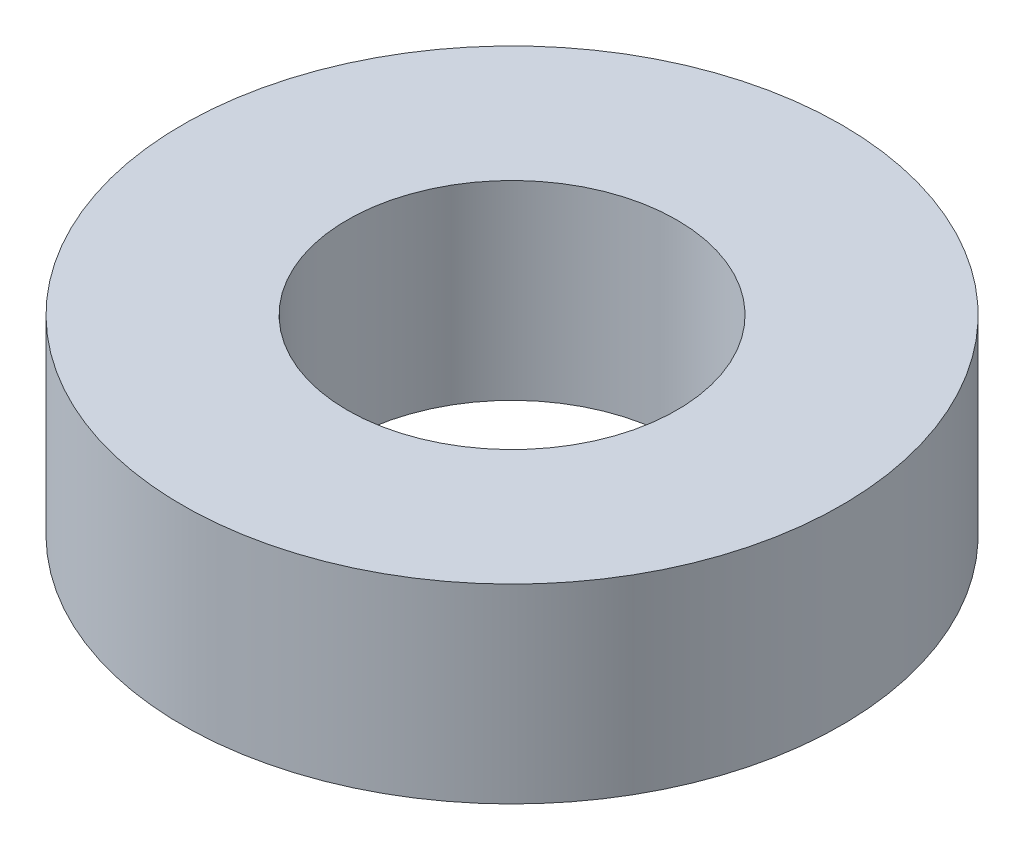
ISO-10303-21;
HEADER;
FILE_DESCRIPTION(('STEP AP214'),'2;1');
FILE_NAME('part.step','',(''),(''),'','','');
FILE_SCHEMA(('AUTOMOTIVE_DESIGN { 1 0 10303 214 1 1 1 1 }'));
ENDSEC;
DATA;
#1=APPLICATION_CONTEXT('core data for automotive mechanical design processes');
#2=APPLICATION_PROTOCOL_DEFINITION('international standard','automotive_design',2000,#1);
#3=PRODUCT_CONTEXT('',#1,'mechanical');
#4=PRODUCT('Part','Part','',(#3));
#5=PRODUCT_RELATED_PRODUCT_CATEGORY('part','',(#4));
#6=PRODUCT_DEFINITION_FORMATION('','',#4);
#7=PRODUCT_DEFINITION_CONTEXT('part definition',#1,'design');
#8=PRODUCT_DEFINITION('design','',#6,#7);
#9=PRODUCT_DEFINITION_SHAPE('','',#8);
#10=(LENGTH_UNIT() NAMED_UNIT(*) SI_UNIT(.MILLI.,.METRE.));
#11=(NAMED_UNIT(*) PLANE_ANGLE_UNIT() SI_UNIT($,.RADIAN.));
#12=(NAMED_UNIT(*) SI_UNIT($,.STERADIAN.) SOLID_ANGLE_UNIT());
#13=UNCERTAINTY_MEASURE_WITH_UNIT(LENGTH_MEASURE(1.E-05),#10,'distance_accuracy_value','');
#14=(GEOMETRIC_REPRESENTATION_CONTEXT(3) GLOBAL_UNCERTAINTY_ASSIGNED_CONTEXT((#13)) GLOBAL_UNIT_ASSIGNED_CONTEXT((#10,
#11,#12)) REPRESENTATION_CONTEXT('',''));
#15=CARTESIAN_POINT('',(0.,0.,0.));
#16=DIRECTION('',(0.,0.,1.));
#17=DIRECTION('',(1.,0.,0.));
#18=AXIS2_PLACEMENT_3D('',#15,#16,#17);
#19=CARTESIAN_POINT('',(0.,26.,0.));
#20=DIRECTION('',(0.,-1.,0.));
#21=DIRECTION('',(0.,0.,-1.));
#22=AXIS2_PLACEMENT_3D('',#19,#20,#21);
#23=CYLINDRICAL_SURFACE('',#22,45.);
#24=CARTESIAN_POINT('',(0.,26.,0.));
#25=DIRECTION('',(0.,1.,0.));
#26=DIRECTION('',(0.,0.,1.));
#27=AXIS2_PLACEMENT_3D('',#24,#25,#26);
#28=CIRCLE('',#27,45.);
#29=CARTESIAN_POINT('',(0.,26.,-45.));
#30=VERTEX_POINT('',#29);
#31=EDGE_CURVE('E10',#30,#30,#28,.T.);
#32=CARTESIAN_POINT('',(0.,0.,0.));
#33=DIRECTION('',(0.,1.,0.));
#34=DIRECTION('',(0.,0.,1.));
#35=AXIS2_PLACEMENT_3D('',#32,#33,#34);
#36=CIRCLE('',#35,45.);
#37=CARTESIAN_POINT('',(0.,0.,-45.));
#38=VERTEX_POINT('',#37);
#39=EDGE_CURVE('E37',#38,#38,#36,.T.);
#40=CARTESIAN_POINT('',(0.,26.,-45.));
#41=CARTESIAN_POINT('',(0.,25.7291666666667,-45.));
#42=CARTESIAN_POINT('',(0.,25.4583333333333,-45.));
#43=CARTESIAN_POINT('',(0.,24.9166666666667,-45.));
#44=CARTESIAN_POINT('',(0.,24.6458333333333,-45.));
#45=CARTESIAN_POINT('',(0.,24.1041666666667,-45.));
#46=CARTESIAN_POINT('',(0.,23.8333333333333,-45.));
#47=CARTESIAN_POINT('',(0.,23.2916666666667,-45.));
#48=CARTESIAN_POINT('',(0.,23.0208333333333,-45.));
#49=CARTESIAN_POINT('',(0.,22.4791666666667,-45.));
#50=CARTESIAN_POINT('',(0.,22.2083333333333,-45.));
#51=CARTESIAN_POINT('',(0.,21.6666666666667,-45.));
#52=CARTESIAN_POINT('',(0.,21.3958333333333,-45.));
#53=CARTESIAN_POINT('',(0.,20.8541666666667,-45.));
#54=CARTESIAN_POINT('',(0.,20.5833333333333,-45.));
#55=CARTESIAN_POINT('',(0.,20.0416666666667,-45.));
#56=CARTESIAN_POINT('',(0.,19.7708333333333,-45.));
#57=CARTESIAN_POINT('',(0.,19.2291666666667,-45.));
#58=CARTESIAN_POINT('',(0.,18.9583333333333,-45.));
#59=CARTESIAN_POINT('',(0.,18.4166666666667,-45.));
#60=CARTESIAN_POINT('',(0.,18.1458333333333,-45.));
#61=CARTESIAN_POINT('',(0.,17.6041666666667,-45.));
#62=CARTESIAN_POINT('',(0.,17.3333333333333,-45.));
#63=CARTESIAN_POINT('',(0.,16.7916666666667,-45.));
#64=CARTESIAN_POINT('',(0.,16.5208333333333,-45.));
#65=CARTESIAN_POINT('',(0.,15.9791666666667,-45.));
#66=CARTESIAN_POINT('',(0.,15.7083333333333,-45.));
#67=CARTESIAN_POINT('',(0.,15.1666666666667,-45.));
#68=CARTESIAN_POINT('',(0.,14.8958333333333,-45.));
#69=CARTESIAN_POINT('',(0.,14.3541666666667,-45.));
#70=CARTESIAN_POINT('',(0.,14.0833333333333,-45.));
#71=CARTESIAN_POINT('',(0.,13.5416666666667,-45.));
#72=CARTESIAN_POINT('',(0.,13.2708333333333,-45.));
#73=CARTESIAN_POINT('',(0.,12.7291666666667,-45.));
#74=CARTESIAN_POINT('',(0.,12.4583333333333,-45.));
#75=CARTESIAN_POINT('',(0.,11.9166666666667,-45.));
#76=CARTESIAN_POINT('',(0.,11.6458333333333,-45.));
#77=CARTESIAN_POINT('',(0.,11.1041666666667,-45.));
#78=CARTESIAN_POINT('',(0.,10.8333333333333,-45.));
#79=CARTESIAN_POINT('',(0.,10.2916666666667,-45.));
#80=CARTESIAN_POINT('',(0.,10.0208333333333,-45.));
#81=CARTESIAN_POINT('',(0.,9.47916666666667,-45.));
#82=CARTESIAN_POINT('',(0.,9.20833333333333,-45.));
#83=CARTESIAN_POINT('',(0.,8.66666666666667,-45.));
#84=CARTESIAN_POINT('',(0.,8.39583333333333,-45.));
#85=CARTESIAN_POINT('',(0.,7.85416666666667,-45.));
#86=CARTESIAN_POINT('',(0.,7.58333333333333,-45.));
#87=CARTESIAN_POINT('',(0.,7.04166666666667,-45.));
#88=CARTESIAN_POINT('',(0.,6.77083333333333,-45.));
#89=CARTESIAN_POINT('',(0.,6.22916666666667,-45.));
#90=CARTESIAN_POINT('',(0.,5.95833333333333,-45.));
#91=CARTESIAN_POINT('',(0.,5.41666666666667,-45.));
#92=CARTESIAN_POINT('',(0.,5.14583333333333,-45.));
#93=CARTESIAN_POINT('',(0.,4.60416666666667,-45.));
#94=CARTESIAN_POINT('',(0.,4.33333333333333,-45.));
#95=CARTESIAN_POINT('',(0.,3.79166666666667,-45.));
#96=CARTESIAN_POINT('',(0.,3.52083333333333,-45.));
#97=CARTESIAN_POINT('',(0.,2.97916666666667,-45.));
#98=CARTESIAN_POINT('',(0.,2.70833333333333,-45.));
#99=CARTESIAN_POINT('',(0.,2.16666666666667,-45.));
#100=CARTESIAN_POINT('',(0.,1.89583333333333,-45.));
#101=CARTESIAN_POINT('',(0.,1.35416666666667,-45.));
#102=CARTESIAN_POINT('',(0.,1.08333333333333,-45.));
#103=CARTESIAN_POINT('',(0.,0.541666666666667,-45.));
#104=CARTESIAN_POINT('',(0.,0.270833333333334,-45.));
#105=CARTESIAN_POINT('',(0.,0.,-45.));
#106=B_SPLINE_CURVE_WITH_KNOTS('',3,(#40,#41,#42,#43,#44,#45,#46,#47,#48,#49,#50,#51,#52,#53,
#54,#55,#56,#57,#58,#59,#60,#61,#62,#63,#64,#65,#66,#67,#68,#69,#70,#71,#72,#73,#74,#75,#76,#77,
#78,#79,#80,#81,#82,#83,#84,#85,#86,#87,#88,#89,#90,#91,#92,#93,#94,#95,#96,#97,#98,#99,#100,
#101,#102,#103,#104,#105),.UNSPECIFIED.,.F.,.F.,(4,2,2,2,2,2,2,2,2,2,2,2,2,2,2,2,2,2,2,2,2,2,2,
2,2,2,2,2,2,2,2,2,4),(0.,0.812499999999997,1.625,2.4375,3.25,4.0625,4.875,5.6875,6.5,7.3125,
8.125,8.93749999999999,9.74999999999999,10.5625,11.375,12.1875,13.,13.8125,14.625,15.4375,16.25,
17.0625,17.875,18.6875,19.5,20.3125,21.125,21.9375,22.75,23.5625,24.375,25.1875,26.),.UNSPECIFIED.);
#107=EDGE_CURVE('BSEAM40',#30,#38,#106,.T.);
#108=ORIENTED_EDGE('',*,*,#31,.F.);
#109=ORIENTED_EDGE('',*,*,#39,.T.);
#110=ORIENTED_EDGE('',*,*,#107,.T.);
#111=ORIENTED_EDGE('',*,*,#107,.F.);
#112=EDGE_LOOP('',(#108,#110,#109,#111));
#113=FACE_BOUND('',#112,.T.);
#114=ADVANCED_FACE('F40',(#113),#23,.T.);
#115=CARTESIAN_POINT('',(0.,26.,0.));
#116=DIRECTION('',(0.,1.,0.));
#117=DIRECTION('',(0.,0.,1.));
#118=AXIS2_PLACEMENT_3D('',#115,#116,#117);
#119=PLANE('',#118);
#120=CARTESIAN_POINT('',(0.,26.,0.));
#121=DIRECTION('',(0.,1.,0.));
#122=DIRECTION('',(0.,0.,1.));
#123=AXIS2_PLACEMENT_3D('',#120,#121,#122);
#124=CIRCLE('',#123,22.5);
#125=CARTESIAN_POINT('',(0.,26.,-22.5));
#126=VERTEX_POINT('',#125);
#127=EDGE_CURVE('E50',#126,#126,#124,.T.);
#128=ORIENTED_EDGE('',*,*,#127,.F.);
#129=EDGE_LOOP('',(#128));
#130=FACE_BOUND('',#129,.T.);
#131=ORIENTED_EDGE('',*,*,#31,.T.);
#132=EDGE_LOOP('',(#131));
#133=FACE_BOUND('',#132,.T.);
#134=ADVANCED_FACE('F59',(#130,#133),#119,.T.);
#135=CARTESIAN_POINT('',(0.,0.,0.));
#136=DIRECTION('',(0.,1.,0.));
#137=DIRECTION('',(0.,0.,1.));
#138=AXIS2_PLACEMENT_3D('',#135,#136,#137);
#139=PLANE('',#138);
#140=CARTESIAN_POINT('',(0.,0.,0.));
#141=DIRECTION('',(0.,1.,0.));
#142=DIRECTION('',(0.,0.,1.));
#143=AXIS2_PLACEMENT_3D('',#140,#141,#142);
#144=CIRCLE('',#143,22.5);
#145=CARTESIAN_POINT('',(0.,0.,-22.5));
#146=VERTEX_POINT('',#145);
#147=EDGE_CURVE('E47',#146,#146,#144,.T.);
#148=ORIENTED_EDGE('',*,*,#147,.T.);
#149=EDGE_LOOP('',(#148));
#150=FACE_BOUND('',#149,.T.);
#151=ORIENTED_EDGE('',*,*,#39,.F.);
#152=EDGE_LOOP('',(#151));
#153=FACE_BOUND('',#152,.T.);
#154=ADVANCED_FACE('F58',(#150,#153),#139,.F.);
#155=CARTESIAN_POINT('',(0.,26.,0.));
#156=DIRECTION('',(0.,-1.,0.));
#157=DIRECTION('',(0.,0.,-1.));
#158=AXIS2_PLACEMENT_3D('',#155,#156,#157);
#159=CYLINDRICAL_SURFACE('',#158,22.5);
#160=CARTESIAN_POINT('',(0.,26.,-22.5));
#161=CARTESIAN_POINT('',(0.,25.7291666666667,-22.5));
#162=CARTESIAN_POINT('',(0.,25.4583333333333,-22.5));
#163=CARTESIAN_POINT('',(0.,24.9166666666667,-22.5));
#164=CARTESIAN_POINT('',(0.,24.6458333333333,-22.5));
#165=CARTESIAN_POINT('',(0.,24.1041666666667,-22.5));
#166=CARTESIAN_POINT('',(0.,23.8333333333333,-22.5));
#167=CARTESIAN_POINT('',(0.,23.2916666666667,-22.5));
#168=CARTESIAN_POINT('',(0.,23.0208333333333,-22.5));
#169=CARTESIAN_POINT('',(0.,22.4791666666667,-22.5));
#170=CARTESIAN_POINT('',(0.,22.2083333333333,-22.5));
#171=CARTESIAN_POINT('',(0.,21.6666666666667,-22.5));
#172=CARTESIAN_POINT('',(0.,21.3958333333333,-22.5));
#173=CARTESIAN_POINT('',(0.,20.8541666666667,-22.5));
#174=CARTESIAN_POINT('',(0.,20.5833333333333,-22.5));
#175=CARTESIAN_POINT('',(0.,20.0416666666667,-22.5));
#176=CARTESIAN_POINT('',(0.,19.7708333333333,-22.5));
#177=CARTESIAN_POINT('',(0.,19.2291666666667,-22.5));
#178=CARTESIAN_POINT('',(0.,18.9583333333333,-22.5));
#179=CARTESIAN_POINT('',(0.,18.4166666666667,-22.5));
#180=CARTESIAN_POINT('',(0.,18.1458333333333,-22.5));
#181=CARTESIAN_POINT('',(0.,17.6041666666667,-22.5));
#182=CARTESIAN_POINT('',(0.,17.3333333333333,-22.5));
#183=CARTESIAN_POINT('',(0.,16.7916666666667,-22.5));
#184=CARTESIAN_POINT('',(0.,16.5208333333333,-22.5));
#185=CARTESIAN_POINT('',(0.,15.9791666666667,-22.5));
#186=CARTESIAN_POINT('',(0.,15.7083333333333,-22.5));
#187=CARTESIAN_POINT('',(0.,15.1666666666667,-22.5));
#188=CARTESIAN_POINT('',(0.,14.8958333333333,-22.5));
#189=CARTESIAN_POINT('',(0.,14.3541666666667,-22.5));
#190=CARTESIAN_POINT('',(0.,14.0833333333333,-22.5));
#191=CARTESIAN_POINT('',(0.,13.5416666666667,-22.5));
#192=CARTESIAN_POINT('',(0.,13.2708333333333,-22.5));
#193=CARTESIAN_POINT('',(0.,12.7291666666667,-22.5));
#194=CARTESIAN_POINT('',(0.,12.4583333333333,-22.5));
#195=CARTESIAN_POINT('',(0.,11.9166666666667,-22.5));
#196=CARTESIAN_POINT('',(0.,11.6458333333333,-22.5));
#197=CARTESIAN_POINT('',(0.,11.1041666666667,-22.5));
#198=CARTESIAN_POINT('',(0.,10.8333333333333,-22.5));
#199=CARTESIAN_POINT('',(0.,10.2916666666667,-22.5));
#200=CARTESIAN_POINT('',(0.,10.0208333333333,-22.5));
#201=CARTESIAN_POINT('',(0.,9.47916666666667,-22.5));
#202=CARTESIAN_POINT('',(0.,9.20833333333333,-22.5));
#203=CARTESIAN_POINT('',(0.,8.66666666666667,-22.5));
#204=CARTESIAN_POINT('',(0.,8.39583333333333,-22.5));
#205=CARTESIAN_POINT('',(0.,7.85416666666667,-22.5));
#206=CARTESIAN_POINT('',(0.,7.58333333333333,-22.5));
#207=CARTESIAN_POINT('',(0.,7.04166666666667,-22.5));
#208=CARTESIAN_POINT('',(0.,6.77083333333333,-22.5));
#209=CARTESIAN_POINT('',(0.,6.22916666666667,-22.5));
#210=CARTESIAN_POINT('',(0.,5.95833333333333,-22.5));
#211=CARTESIAN_POINT('',(0.,5.41666666666667,-22.5));
#212=CARTESIAN_POINT('',(0.,5.14583333333333,-22.5));
#213=CARTESIAN_POINT('',(0.,4.60416666666667,-22.5));
#214=CARTESIAN_POINT('',(0.,4.33333333333333,-22.5));
#215=CARTESIAN_POINT('',(0.,3.79166666666667,-22.5));
#216=CARTESIAN_POINT('',(0.,3.52083333333333,-22.5));
#217=CARTESIAN_POINT('',(0.,2.97916666666667,-22.5));
#218=CARTESIAN_POINT('',(0.,2.70833333333333,-22.5));
#219=CARTESIAN_POINT('',(0.,2.16666666666667,-22.5));
#220=CARTESIAN_POINT('',(0.,1.89583333333333,-22.5));
#221=CARTESIAN_POINT('',(0.,1.35416666666667,-22.5));
#222=CARTESIAN_POINT('',(0.,1.08333333333333,-22.5));
#223=CARTESIAN_POINT('',(0.,0.541666666666667,-22.5));
#224=CARTESIAN_POINT('',(0.,0.270833333333334,-22.5));
#225=CARTESIAN_POINT('',(0.,0.,-22.5));
#226=B_SPLINE_CURVE_WITH_KNOTS('',3,(#160,#161,#162,#163,#164,#165,#166,#167,#168,#169,#170,
#171,#172,#173,#174,#175,#176,#177,#178,#179,#180,#181,#182,#183,#184,#185,#186,#187,#188,#189,
#190,#191,#192,#193,#194,#195,#196,#197,#198,#199,#200,#201,#202,#203,#204,#205,#206,#207,#208,
#209,#210,#211,#212,#213,#214,#215,#216,#217,#218,#219,#220,#221,#222,#223,#224,#225),
.UNSPECIFIED.,.F.,.F.,(4,2,2,2,2,2,2,2,2,2,2,2,2,2,2,2,2,2,2,2,2,2,2,2,2,2,2,2,2,2,2,2,4),(0.,
0.812499999999997,1.625,2.4375,3.25,4.0625,4.875,5.6875,6.5,7.3125,8.125,8.93749999999999,
9.74999999999999,10.5625,11.375,12.1875,13.,13.8125,14.625,15.4375,16.25,17.0625,17.875,18.6875,
19.5,20.3125,21.125,21.9375,22.75,23.5625,24.375,25.1875,26.),.UNSPECIFIED.);
#227=EDGE_CURVE('BSEAM54',#126,#146,#226,.T.);
#228=ORIENTED_EDGE('',*,*,#127,.T.);
#229=ORIENTED_EDGE('',*,*,#147,.F.);
#230=ORIENTED_EDGE('',*,*,#227,.T.);
#231=ORIENTED_EDGE('',*,*,#227,.F.);
#232=EDGE_LOOP('',(#228,#230,#229,#231));
#233=FACE_BOUND('',#232,.T.);
#234=ADVANCED_FACE('F54',(#233),#159,.F.);
#235=CLOSED_SHELL('',(#114,#134,#154,#234));
#236=MANIFOLD_SOLID_BREP('B2',#235);
#237=ADVANCED_BREP_SHAPE_REPRESENTATION('',(#18,#236),#14);
#238=SHAPE_DEFINITION_REPRESENTATION(#9,#237);
ENDSEC;
END-ISO-10303-21;
